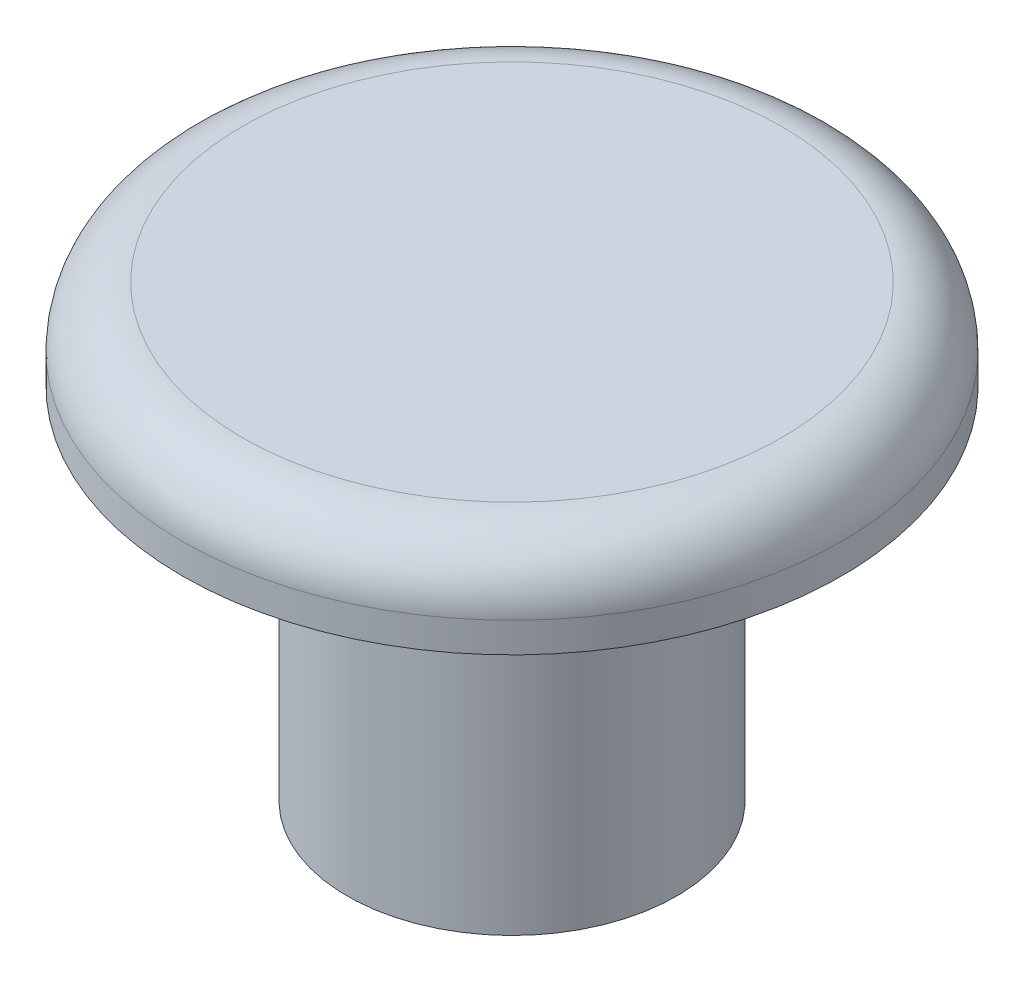
ISO-10303-21;
HEADER;
FILE_DESCRIPTION(('STEP AP214'),'2;1');
FILE_NAME('part.step','',(''),(''),'','','');
FILE_SCHEMA(('AUTOMOTIVE_DESIGN { 1 0 10303 214 1 1 1 1 }'));
ENDSEC;
DATA;
#1=APPLICATION_CONTEXT('core data for automotive mechanical design processes');
#2=APPLICATION_PROTOCOL_DEFINITION('international standard','automotive_design',2000,#1);
#3=PRODUCT_CONTEXT('',#1,'mechanical');
#4=PRODUCT('Part','Part','',(#3));
#5=PRODUCT_RELATED_PRODUCT_CATEGORY('part','',(#4));
#6=PRODUCT_DEFINITION_FORMATION('','',#4);
#7=PRODUCT_DEFINITION_CONTEXT('part definition',#1,'design');
#8=PRODUCT_DEFINITION('design','',#6,#7);
#9=PRODUCT_DEFINITION_SHAPE('','',#8);
#10=(LENGTH_UNIT() NAMED_UNIT(*) SI_UNIT(.MILLI.,.METRE.));
#11=(NAMED_UNIT(*) PLANE_ANGLE_UNIT() SI_UNIT($,.RADIAN.));
#12=(NAMED_UNIT(*) SI_UNIT($,.STERADIAN.) SOLID_ANGLE_UNIT());
#13=UNCERTAINTY_MEASURE_WITH_UNIT(LENGTH_MEASURE(1.E-05),#10,'distance_accuracy_value','');
#14=(GEOMETRIC_REPRESENTATION_CONTEXT(3) GLOBAL_UNCERTAINTY_ASSIGNED_CONTEXT((#13)) GLOBAL_UNIT_ASSIGNED_CONTEXT((#10,
#11,#12)) REPRESENTATION_CONTEXT('',''));
#15=CARTESIAN_POINT('',(0.,0.,0.));
#16=DIRECTION('',(0.,0.,1.));
#17=DIRECTION('',(1.,0.,0.));
#18=AXIS2_PLACEMENT_3D('',#15,#16,#17);
#19=CARTESIAN_POINT('',(0.,3.,0.));
#20=DIRECTION('',(0.,-1.,0.));
#21=DIRECTION('',(0.,0.,-1.));
#22=AXIS2_PLACEMENT_3D('',#19,#20,#21);
#23=CYLINDRICAL_SURFACE('',#22,11.);
#24=CARTESIAN_POINT('',(0.,1.,0.));
#25=DIRECTION('',(0.,1.,0.));
#26=DIRECTION('',(0.,0.,1.));
#27=AXIS2_PLACEMENT_3D('',#24,#25,#26);
#28=CIRCLE('',#27,11.);
#29=CARTESIAN_POINT('',(0.,1.,11.));
#30=VERTEX_POINT('',#29);
#31=EDGE_CURVE('E41',#30,#30,#28,.F.);
#32=ORIENTED_EDGE('',*,*,#31,.T.);
#33=EDGE_LOOP('',(#32));
#34=FACE_BOUND('',#33,.T.);
#35=CARTESIAN_POINT('',(0.,0.,0.));
#36=DIRECTION('',(0.,1.,0.));
#37=DIRECTION('',(0.,0.,1.));
#38=AXIS2_PLACEMENT_3D('',#35,#36,#37);
#39=CIRCLE('',#38,11.);
#40=CARTESIAN_POINT('',(0.,0.,11.));
#41=VERTEX_POINT('',#40);
#42=EDGE_CURVE('E55',#41,#41,#39,.T.);
#43=ORIENTED_EDGE('',*,*,#42,.T.);
#44=EDGE_LOOP('',(#43));
#45=FACE_BOUND('',#44,.T.);
#46=ADVANCED_FACE('F37',(#34,#45),#23,.T.);
#47=CARTESIAN_POINT('',(0.,3.,0.));
#48=DIRECTION('',(0.,1.,0.));
#49=DIRECTION('',(0.,0.,1.));
#50=AXIS2_PLACEMENT_3D('',#47,#48,#49);
#51=PLANE('',#50);
#52=CARTESIAN_POINT('',(0.,3.,0.));
#53=DIRECTION('',(0.,1.,0.));
#54=DIRECTION('',(0.,0.,1.));
#55=AXIS2_PLACEMENT_3D('',#52,#53,#54);
#56=CIRCLE('',#55,9.);
#57=CARTESIAN_POINT('',(0.,3.,9.));
#58=VERTEX_POINT('',#57);
#59=EDGE_CURVE('E51',#58,#58,#56,.T.);
#60=ORIENTED_EDGE('',*,*,#59,.T.);
#61=EDGE_LOOP('',(#60));
#62=FACE_BOUND('',#61,.T.);
#63=ADVANCED_FACE('F62',(#62),#51,.T.);
#64=CARTESIAN_POINT('',(0.,0.,0.));
#65=DIRECTION('',(0.,1.,0.));
#66=DIRECTION('',(0.,0.,1.));
#67=AXIS2_PLACEMENT_3D('',#64,#65,#66);
#68=PLANE('',#67);
#69=CARTESIAN_POINT('',(0.,0.,0.));
#70=DIRECTION('',(0.,-1.,0.));
#71=DIRECTION('',(0.,0.,-1.));
#72=AXIS2_PLACEMENT_3D('',#69,#70,#71);
#73=CIRCLE('',#72,5.5);
#74=CARTESIAN_POINT('',(0.,0.,-5.5));
#75=VERTEX_POINT('',#74);
#76=EDGE_CURVE('E10',#75,#75,#73,.T.);
#77=ORIENTED_EDGE('',*,*,#76,.F.);
#78=EDGE_LOOP('',(#77));
#79=FACE_BOUND('',#78,.T.);
#80=ORIENTED_EDGE('',*,*,#42,.F.);
#81=EDGE_LOOP('',(#80));
#82=FACE_BOUND('',#81,.T.);
#83=ADVANCED_FACE('F66',(#79,#82),#68,.F.);
#84=CARTESIAN_POINT('',(0.,1.,0.));
#85=DIRECTION('',(0.,1.,0.));
#86=DIRECTION('',(0.,0.,1.));
#87=AXIS2_PLACEMENT_3D('',#84,#85,#86);
#88=TOROIDAL_SURFACE('',#87,9.,2.);
#89=ORIENTED_EDGE('',*,*,#31,.F.);
#90=EDGE_LOOP('',(#89));
#91=FACE_BOUND('',#90,.T.);
#92=ORIENTED_EDGE('',*,*,#59,.F.);
#93=EDGE_LOOP('',(#92));
#94=FACE_BOUND('',#93,.T.);
#95=ADVANCED_FACE('F39',(#91,#94),#88,.T.);
#96=CARTESIAN_POINT('',(0.,-12.,0.));
#97=DIRECTION('',(0.,1.,0.));
#98=DIRECTION('',(0.,0.,1.));
#99=AXIS2_PLACEMENT_3D('',#96,#97,#98);
#100=CYLINDRICAL_SURFACE('',#99,5.5);
#101=CARTESIAN_POINT('',(0.,-12.,0.));
#102=DIRECTION('',(0.,-1.,0.));
#103=DIRECTION('',(0.,0.,-1.));
#104=AXIS2_PLACEMENT_3D('',#101,#102,#103);
#105=CIRCLE('',#104,5.5);
#106=CARTESIAN_POINT('',(0.,-12.,-5.5));
#107=VERTEX_POINT('',#106);
#108=EDGE_CURVE('E54',#107,#107,#105,.T.);
#109=ORIENTED_EDGE('',*,*,#108,.F.);
#110=EDGE_LOOP('',(#109));
#111=FACE_BOUND('',#110,.T.);
#112=ORIENTED_EDGE('',*,*,#76,.T.);
#113=EDGE_LOOP('',(#112));
#114=FACE_BOUND('',#113,.T.);
#115=ADVANCED_FACE('F65',(#111,#114),#100,.T.);
#116=CARTESIAN_POINT('',(0.,-12.,0.));
#117=DIRECTION('',(0.,-1.,0.));
#118=DIRECTION('',(0.,0.,-1.));
#119=AXIS2_PLACEMENT_3D('',#116,#117,#118);
#120=PLANE('',#119);
#121=ORIENTED_EDGE('',*,*,#108,.T.);
#122=EDGE_LOOP('',(#121));
#123=FACE_BOUND('',#122,.T.);
#124=ADVANCED_FACE('F72',(#123),#120,.T.);
#125=CLOSED_SHELL('',(#46,#63,#83,#95,#115,#124));
#126=MANIFOLD_SOLID_BREP('B2',#125);
#127=ADVANCED_BREP_SHAPE_REPRESENTATION('',(#18,#126),#14);
#128=SHAPE_DEFINITION_REPRESENTATION(#9,#127);
ENDSEC;
END-ISO-10303-21;
